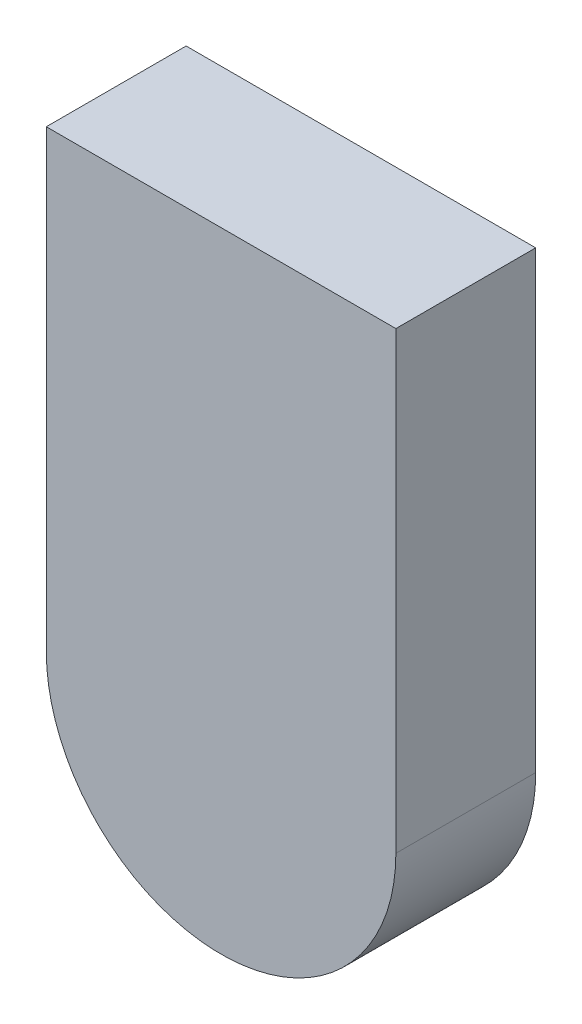
ISO-10303-21;
HEADER;
FILE_DESCRIPTION(('STEP AP214'),'2;1');
FILE_NAME('part.step','',(''),(''),'','','');
FILE_SCHEMA(('AUTOMOTIVE_DESIGN { 1 0 10303 214 1 1 1 1 }'));
ENDSEC;
DATA;
#1=APPLICATION_CONTEXT('core data for automotive mechanical design processes');
#2=APPLICATION_PROTOCOL_DEFINITION('international standard','automotive_design',2000,#1);
#3=PRODUCT_CONTEXT('',#1,'mechanical');
#4=PRODUCT('Part','Part','',(#3));
#5=PRODUCT_RELATED_PRODUCT_CATEGORY('part','',(#4));
#6=PRODUCT_DEFINITION_FORMATION('','',#4);
#7=PRODUCT_DEFINITION_CONTEXT('part definition',#1,'design');
#8=PRODUCT_DEFINITION('design','',#6,#7);
#9=PRODUCT_DEFINITION_SHAPE('','',#8);
#10=(LENGTH_UNIT() NAMED_UNIT(*) SI_UNIT(.MILLI.,.METRE.));
#11=(NAMED_UNIT(*) PLANE_ANGLE_UNIT() SI_UNIT($,.RADIAN.));
#12=(NAMED_UNIT(*) SI_UNIT($,.STERADIAN.) SOLID_ANGLE_UNIT());
#13=UNCERTAINTY_MEASURE_WITH_UNIT(LENGTH_MEASURE(1.E-05),#10,'distance_accuracy_value','');
#14=(GEOMETRIC_REPRESENTATION_CONTEXT(3) GLOBAL_UNCERTAINTY_ASSIGNED_CONTEXT((#13)) GLOBAL_UNIT_ASSIGNED_CONTEXT((#10,
#11,#12)) REPRESENTATION_CONTEXT('',''));
#15=CARTESIAN_POINT('',(0.,0.,0.));
#16=DIRECTION('',(0.,0.,1.));
#17=DIRECTION('',(1.,0.,0.));
#18=AXIS2_PLACEMENT_3D('',#15,#16,#17);
#19=CARTESIAN_POINT('',(-0.375,2.05,0.));
#20=DIRECTION('',(0.,1.,0.));
#21=DIRECTION('',(1.,0.,0.));
#22=AXIS2_PLACEMENT_3D('',#19,#20,#21);
#23=PLANE('',#22);
#24=DIRECTION('',(0.,0.,1.));
#25=VECTOR('',#24,1.);
#26=CARTESIAN_POINT('',(-0.375,2.05,0.));
#27=LINE('',#26,#25);
#28=CARTESIAN_POINT('',(-0.375,2.05,0.));
#29=VERTEX_POINT('',#28);
#30=CARTESIAN_POINT('',(-0.375,2.05,0.1));
#31=VERTEX_POINT('',#30);
#32=EDGE_CURVE('E11',#29,#31,#27,.T.);
#33=ORIENTED_EDGE('',*,*,#32,.T.);
#34=DIRECTION('',(1.,0.,0.));
#35=VECTOR('',#34,1.);
#36=CARTESIAN_POINT('',(-0.375,2.05,0.1));
#37=LINE('',#36,#35);
#38=CARTESIAN_POINT('',(-0.125,2.05,0.1));
#39=VERTEX_POINT('',#38);
#40=EDGE_CURVE('E24',#31,#39,#37,.T.);
#41=ORIENTED_EDGE('',*,*,#40,.T.);
#42=DIRECTION('',(0.,0.,1.));
#43=VECTOR('',#42,1.);
#44=CARTESIAN_POINT('',(-0.125,2.05,0.));
#45=LINE('',#44,#43);
#46=CARTESIAN_POINT('',(-0.125,2.05,0.));
#47=VERTEX_POINT('',#46);
#48=EDGE_CURVE('E85',#47,#39,#45,.T.);
#49=ORIENTED_EDGE('',*,*,#48,.F.);
#50=DIRECTION('',(1.,0.,0.));
#51=VECTOR('',#50,1.);
#52=CARTESIAN_POINT('',(-0.375,2.05,0.));
#53=LINE('',#52,#51);
#54=EDGE_CURVE('E82',#29,#47,#53,.T.);
#55=ORIENTED_EDGE('',*,*,#54,.F.);
#56=EDGE_LOOP('',(#33,#41,#49,#55));
#57=FACE_BOUND('',#56,.T.);
#58=ADVANCED_FACE('F17',(#57),#23,.T.);
#59=CARTESIAN_POINT('',(-0.125,2.05,0.));
#60=DIRECTION('',(1.,0.,0.));
#61=DIRECTION('',(0.,-1.,0.));
#62=AXIS2_PLACEMENT_3D('',#59,#60,#61);
#63=PLANE('',#62);
#64=ORIENTED_EDGE('',*,*,#48,.T.);
#65=DIRECTION('',(0.,-1.,0.));
#66=VECTOR('',#65,1.);
#67=CARTESIAN_POINT('',(-0.125,2.05,0.1));
#68=LINE('',#67,#66);
#69=CARTESIAN_POINT('',(-0.125,1.725,0.1));
#70=VERTEX_POINT('',#69);
#71=EDGE_CURVE('E80',#39,#70,#68,.T.);
#72=ORIENTED_EDGE('',*,*,#71,.T.);
#73=DIRECTION('',(0.,0.,1.));
#74=VECTOR('',#73,1.);
#75=CARTESIAN_POINT('',(-0.125,1.725,0.));
#76=LINE('',#75,#74);
#77=CARTESIAN_POINT('',(-0.125,1.725,0.));
#78=VERTEX_POINT('',#77);
#79=EDGE_CURVE('E60',#78,#70,#76,.T.);
#80=ORIENTED_EDGE('',*,*,#79,.F.);
#81=DIRECTION('',(0.,-1.,0.));
#82=VECTOR('',#81,1.);
#83=CARTESIAN_POINT('',(-0.125,2.05,0.));
#84=LINE('',#83,#82);
#85=EDGE_CURVE('E76',#47,#78,#84,.T.);
#86=ORIENTED_EDGE('',*,*,#85,.F.);
#87=EDGE_LOOP('',(#64,#72,#80,#86));
#88=FACE_BOUND('',#87,.T.);
#89=ADVANCED_FACE('F89',(#88),#63,.T.);
#90=CARTESIAN_POINT('',(-0.25,1.725,0.));
#91=DIRECTION('',(0.,0.,-1.));
#92=DIRECTION('',(1.,0.,0.));
#93=AXIS2_PLACEMENT_3D('',#90,#91,#92);
#94=CYLINDRICAL_SURFACE('',#93,0.125);
#95=CARTESIAN_POINT('',(-0.25,1.725,0.));
#96=DIRECTION('',(0.,0.,1.));
#97=DIRECTION('',(1.,0.,0.));
#98=AXIS2_PLACEMENT_3D('',#95,#96,#97);
#99=CIRCLE('',#98,0.125);
#100=CARTESIAN_POINT('',(-0.375,1.725,0.));
#101=VERTEX_POINT('',#100);
#102=EDGE_CURVE('E64',#101,#78,#99,.T.);
#103=ORIENTED_EDGE('',*,*,#102,.T.);
#104=ORIENTED_EDGE('',*,*,#79,.T.);
#105=CARTESIAN_POINT('',(-0.25,1.725,0.1));
#106=DIRECTION('',(0.,0.,1.));
#107=DIRECTION('',(1.,0.,0.));
#108=AXIS2_PLACEMENT_3D('',#105,#106,#107);
#109=CIRCLE('',#108,0.125);
#110=CARTESIAN_POINT('',(-0.375,1.725,0.1));
#111=VERTEX_POINT('',#110);
#112=EDGE_CURVE('E55',#111,#70,#109,.T.);
#113=ORIENTED_EDGE('',*,*,#112,.F.);
#114=DIRECTION('',(0.,0.,1.));
#115=VECTOR('',#114,1.);
#116=CARTESIAN_POINT('',(-0.375,1.725,0.));
#117=LINE('',#116,#115);
#118=EDGE_CURVE('E59',#101,#111,#117,.T.);
#119=ORIENTED_EDGE('',*,*,#118,.F.);
#120=EDGE_LOOP('',(#103,#104,#113,#119));
#121=FACE_BOUND('',#120,.T.);
#122=ADVANCED_FACE('F58',(#121),#94,.T.);
#123=CARTESIAN_POINT('',(-0.375,2.05,0.));
#124=DIRECTION('',(1.,0.,0.));
#125=DIRECTION('',(0.,-1.,0.));
#126=AXIS2_PLACEMENT_3D('',#123,#124,#125);
#127=PLANE('',#126);
#128=DIRECTION('',(0.,-1.,0.));
#129=VECTOR('',#128,1.);
#130=CARTESIAN_POINT('',(-0.375,2.05,0.));
#131=LINE('',#130,#129);
#132=EDGE_CURVE('E69',#29,#101,#131,.T.);
#133=ORIENTED_EDGE('',*,*,#132,.T.);
#134=ORIENTED_EDGE('',*,*,#118,.T.);
#135=DIRECTION('',(0.,-1.,0.));
#136=VECTOR('',#135,1.);
#137=CARTESIAN_POINT('',(-0.375,2.05,0.1));
#138=LINE('',#137,#136);
#139=EDGE_CURVE('E67',#31,#111,#138,.T.);
#140=ORIENTED_EDGE('',*,*,#139,.F.);
#141=ORIENTED_EDGE('',*,*,#32,.F.);
#142=EDGE_LOOP('',(#133,#134,#140,#141));
#143=FACE_BOUND('',#142,.T.);
#144=ADVANCED_FACE('F66',(#143),#127,.F.);
#145=CARTESIAN_POINT('',(-0.25,1.850342514613,0.));
#146=DIRECTION('',(0.,0.,-1.));
#147=DIRECTION('',(-1.,0.,0.));
#148=AXIS2_PLACEMENT_3D('',#145,#146,#147);
#149=PLANE('',#148);
#150=ORIENTED_EDGE('',*,*,#54,.T.);
#151=ORIENTED_EDGE('',*,*,#85,.T.);
#152=ORIENTED_EDGE('',*,*,#102,.F.);
#153=ORIENTED_EDGE('',*,*,#132,.F.);
#154=EDGE_LOOP('',(#150,#151,#152,#153));
#155=FACE_BOUND('',#154,.T.);
#156=ADVANCED_FACE('F91',(#155),#149,.T.);
#157=CARTESIAN_POINT('',(-0.25,1.850342514613,0.1));
#158=DIRECTION('',(0.,0.,-1.));
#159=DIRECTION('',(-1.,0.,0.));
#160=AXIS2_PLACEMENT_3D('',#157,#158,#159);
#161=PLANE('',#160);
#162=ORIENTED_EDGE('',*,*,#139,.T.);
#163=ORIENTED_EDGE('',*,*,#112,.T.);
#164=ORIENTED_EDGE('',*,*,#71,.F.);
#165=ORIENTED_EDGE('',*,*,#40,.F.);
#166=EDGE_LOOP('',(#162,#163,#164,#165));
#167=FACE_BOUND('',#166,.T.);
#168=ADVANCED_FACE('F71',(#167),#161,.F.);
#169=CLOSED_SHELL('',(#58,#89,#122,#144,#156,#168));
#170=MANIFOLD_SOLID_BREP('B1',#169);
#171=ADVANCED_BREP_SHAPE_REPRESENTATION('',(#18,#170),#14);
#172=SHAPE_DEFINITION_REPRESENTATION(#9,#171);
ENDSEC;
END-ISO-10303-21;
